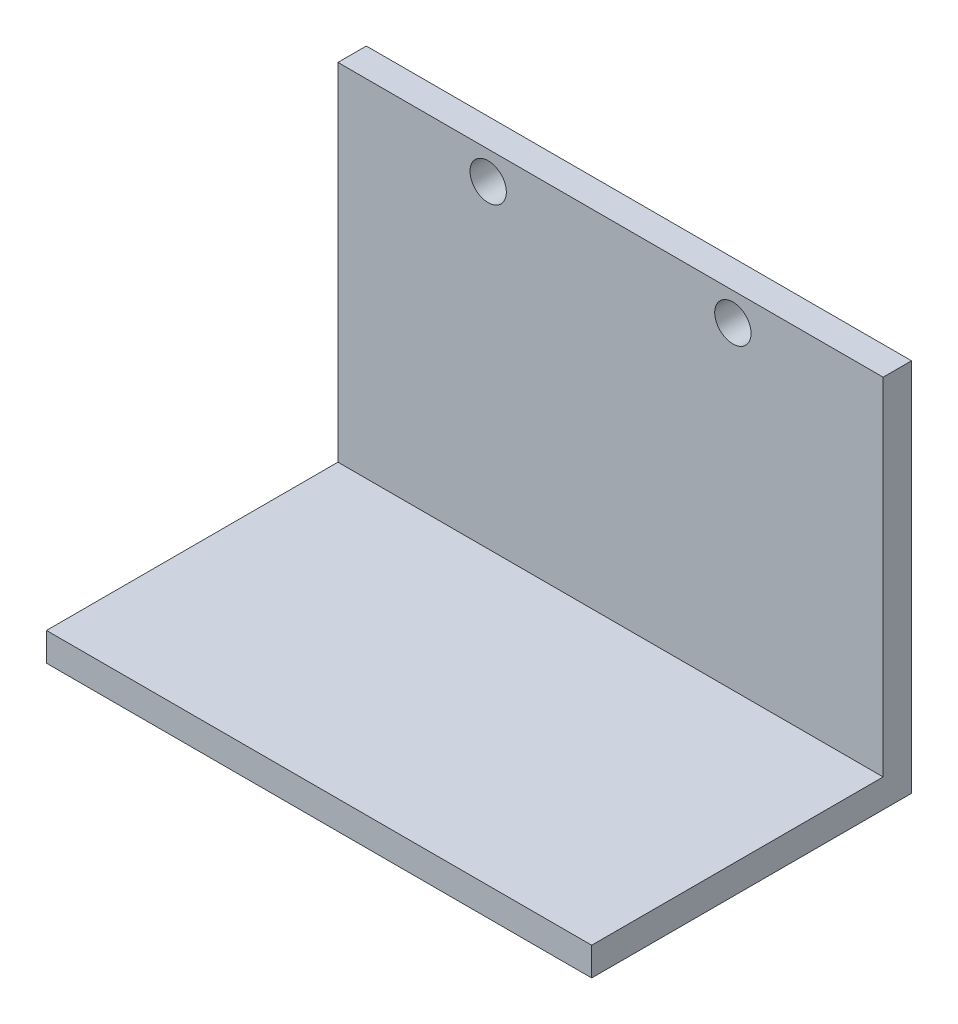
ISO-10303-21;
HEADER;
FILE_DESCRIPTION(('STEP AP214'),'2;1');
FILE_NAME('part.step','',(''),(''),'','','');
FILE_SCHEMA(('AUTOMOTIVE_DESIGN { 1 0 10303 214 1 1 1 1 }'));
ENDSEC;
DATA;
#1=APPLICATION_CONTEXT('core data for automotive mechanical design processes');
#2=APPLICATION_PROTOCOL_DEFINITION('international standard','automotive_design',2000,#1);
#3=PRODUCT_CONTEXT('',#1,'mechanical');
#4=PRODUCT('Part','Part','',(#3));
#5=PRODUCT_RELATED_PRODUCT_CATEGORY('part','',(#4));
#6=PRODUCT_DEFINITION_FORMATION('','',#4);
#7=PRODUCT_DEFINITION_CONTEXT('part definition',#1,'design');
#8=PRODUCT_DEFINITION('design','',#6,#7);
#9=PRODUCT_DEFINITION_SHAPE('','',#8);
#10=(LENGTH_UNIT() NAMED_UNIT(*) SI_UNIT(.MILLI.,.METRE.));
#11=(NAMED_UNIT(*) PLANE_ANGLE_UNIT() SI_UNIT($,.RADIAN.));
#12=(NAMED_UNIT(*) SI_UNIT($,.STERADIAN.) SOLID_ANGLE_UNIT());
#13=UNCERTAINTY_MEASURE_WITH_UNIT(LENGTH_MEASURE(1.E-05),#10,'distance_accuracy_value','');
#14=(GEOMETRIC_REPRESENTATION_CONTEXT(3) GLOBAL_UNCERTAINTY_ASSIGNED_CONTEXT((#13)) GLOBAL_UNIT_ASSIGNED_CONTEXT((#10,
#11,#12)) REPRESENTATION_CONTEXT('',''));
#15=CARTESIAN_POINT('',(0.,0.,0.));
#16=DIRECTION('',(0.,0.,1.));
#17=DIRECTION('',(1.,0.,0.));
#18=AXIS2_PLACEMENT_3D('',#15,#16,#17);
#19=CARTESIAN_POINT('',(60.,0.,-35.1979965784261));
#20=DIRECTION('',(0.,0.,1.));
#21=DIRECTION('',(1.,0.,0.));
#22=AXIS2_PLACEMENT_3D('',#19,#20,#21);
#23=PLANE('',#22);
#24=CARTESIAN_POINT('',(43.4647260972209,35.,-35.1979965784261));
#25=DIRECTION('',(0.,0.,1.));
#26=DIRECTION('',(1.,0.,0.));
#27=AXIS2_PLACEMENT_3D('',#24,#25,#26);
#28=CIRCLE('',#27,2.);
#29=CARTESIAN_POINT('',(45.4647260972209,35.,-35.1979965784261));
#30=VERTEX_POINT('',#29);
#31=EDGE_CURVE('E160',#30,#30,#28,.T.);
#32=ORIENTED_EDGE('',*,*,#31,.T.);
#33=EDGE_LOOP('',(#32));
#34=FACE_BOUND('',#33,.T.);
#35=CARTESIAN_POINT('',(16.5352739027791,35.,-35.1979965784261));
#36=DIRECTION('',(0.,0.,1.));
#37=DIRECTION('',(1.,0.,0.));
#38=AXIS2_PLACEMENT_3D('',#35,#36,#37);
#39=CIRCLE('',#38,2.);
#40=CARTESIAN_POINT('',(18.5352739027791,35.,-35.1979965784261));
#41=VERTEX_POINT('',#40);
#42=EDGE_CURVE('E117',#41,#41,#39,.T.);
#43=ORIENTED_EDGE('',*,*,#42,.T.);
#44=EDGE_LOOP('',(#43));
#45=FACE_BOUND('',#44,.T.);
#46=DIRECTION('',(0.,1.,0.));
#47=VECTOR('',#46,1.);
#48=CARTESIAN_POINT('',(0.,0.,-35.1979965784261));
#49=LINE('',#48,#47);
#50=CARTESIAN_POINT('',(0.,-3.125,-35.1979965784261));
#51=VERTEX_POINT('',#50);
#52=CARTESIAN_POINT('',(0.,38.1,-35.1979965784261));
#53=VERTEX_POINT('',#52);
#54=EDGE_CURVE('E113',#51,#53,#49,.T.);
#55=ORIENTED_EDGE('',*,*,#54,.T.);
#56=DIRECTION('',(-1.,0.,0.));
#57=VECTOR('',#56,1.);
#58=CARTESIAN_POINT('',(60.,38.1,-35.1979965784261));
#59=LINE('',#58,#57);
#60=CARTESIAN_POINT('',(60.,38.1,-35.1979965784261));
#61=VERTEX_POINT('',#60);
#62=EDGE_CURVE('E11',#61,#53,#59,.T.);
#63=ORIENTED_EDGE('',*,*,#62,.F.);
#64=DIRECTION('',(0.,1.,0.));
#65=VECTOR('',#64,1.);
#66=CARTESIAN_POINT('',(60.,0.,-35.1979965784261));
#67=LINE('',#66,#65);
#68=CARTESIAN_POINT('',(60.,-3.125,-35.1979965784261));
#69=VERTEX_POINT('',#68);
#70=EDGE_CURVE('E78',#69,#61,#67,.T.);
#71=ORIENTED_EDGE('',*,*,#70,.F.);
#72=DIRECTION('',(-1.,0.,0.));
#73=VECTOR('',#72,1.);
#74=CARTESIAN_POINT('',(60.,-3.125,-35.1979965784261));
#75=LINE('',#74,#73);
#76=EDGE_CURVE('E109',#69,#51,#75,.T.);
#77=ORIENTED_EDGE('',*,*,#76,.T.);
#78=EDGE_LOOP('',(#55,#63,#71,#77));
#79=FACE_BOUND('',#78,.T.);
#80=ADVANCED_FACE('F32',(#34,#45,#79),#23,.F.);
#81=CARTESIAN_POINT('',(60.,38.1,-32.0729965784261));
#82=DIRECTION('',(0.,1.,0.));
#83=DIRECTION('',(0.,0.,1.));
#84=AXIS2_PLACEMENT_3D('',#81,#82,#83);
#85=PLANE('',#84);
#86=DIRECTION('',(0.,0.,-1.));
#87=VECTOR('',#86,1.);
#88=CARTESIAN_POINT('',(0.,38.1,-32.0729965784261));
#89=LINE('',#88,#87);
#90=CARTESIAN_POINT('',(0.,38.1,-32.0729965784261));
#91=VERTEX_POINT('',#90);
#92=EDGE_CURVE('E116',#91,#53,#89,.T.);
#93=ORIENTED_EDGE('',*,*,#92,.F.);
#94=DIRECTION('',(-1.,0.,0.));
#95=VECTOR('',#94,1.);
#96=CARTESIAN_POINT('',(60.,38.1,-32.0729965784261));
#97=LINE('',#96,#95);
#98=CARTESIAN_POINT('',(60.,38.1,-32.0729965784261));
#99=VERTEX_POINT('',#98);
#100=EDGE_CURVE('E40',#99,#91,#97,.T.);
#101=ORIENTED_EDGE('',*,*,#100,.F.);
#102=DIRECTION('',(0.,0.,-1.));
#103=VECTOR('',#102,1.);
#104=CARTESIAN_POINT('',(60.,38.1,-32.0729965784261));
#105=LINE('',#104,#103);
#106=EDGE_CURVE('E171',#99,#61,#105,.T.);
#107=ORIENTED_EDGE('',*,*,#106,.T.);
#108=ORIENTED_EDGE('',*,*,#62,.T.);
#109=EDGE_LOOP('',(#93,#101,#107,#108));
#110=FACE_BOUND('',#109,.T.);
#111=ADVANCED_FACE('F135',(#110),#85,.T.);
#112=CARTESIAN_POINT('',(60.,0.,-32.0729965784261));
#113=DIRECTION('',(0.,0.,1.));
#114=DIRECTION('',(1.,0.,0.));
#115=AXIS2_PLACEMENT_3D('',#112,#113,#114);
#116=PLANE('',#115);
#117=CARTESIAN_POINT('',(43.4647260972209,35.,-32.0729965784261));
#118=DIRECTION('',(0.,0.,1.));
#119=DIRECTION('',(1.,0.,0.));
#120=AXIS2_PLACEMENT_3D('',#117,#118,#119);
#121=CIRCLE('',#120,2.);
#122=CARTESIAN_POINT('',(45.4647260972209,35.,-32.0729965784261));
#123=VERTEX_POINT('',#122);
#124=EDGE_CURVE('E173',#123,#123,#121,.T.);
#125=ORIENTED_EDGE('',*,*,#124,.F.);
#126=EDGE_LOOP('',(#125));
#127=FACE_BOUND('',#126,.T.);
#128=CARTESIAN_POINT('',(16.5352739027791,35.,-32.0729965784261));
#129=DIRECTION('',(0.,0.,1.));
#130=DIRECTION('',(1.,0.,0.));
#131=AXIS2_PLACEMENT_3D('',#128,#129,#130);
#132=CIRCLE('',#131,2.);
#133=CARTESIAN_POINT('',(18.5352739027791,35.,-32.0729965784261));
#134=VERTEX_POINT('',#133);
#135=EDGE_CURVE('E164',#134,#134,#132,.T.);
#136=ORIENTED_EDGE('',*,*,#135,.F.);
#137=EDGE_LOOP('',(#136));
#138=FACE_BOUND('',#137,.T.);
#139=DIRECTION('',(0.,1.,0.));
#140=VECTOR('',#139,1.);
#141=CARTESIAN_POINT('',(0.,0.,-32.0729965784261));
#142=LINE('',#141,#140);
#143=CARTESIAN_POINT('',(0.,0.,-32.0729965784261));
#144=VERTEX_POINT('',#143);
#145=EDGE_CURVE('E120',#144,#91,#142,.T.);
#146=ORIENTED_EDGE('',*,*,#145,.F.);
#147=DIRECTION('',(-1.,0.,0.));
#148=VECTOR('',#147,1.);
#149=CARTESIAN_POINT('',(60.,0.,-32.0729965784261));
#150=LINE('',#149,#148);
#151=CARTESIAN_POINT('',(60.,0.,-32.0729965784261));
#152=VERTEX_POINT('',#151);
#153=EDGE_CURVE('E99',#152,#144,#150,.T.);
#154=ORIENTED_EDGE('',*,*,#153,.F.);
#155=DIRECTION('',(0.,1.,0.));
#156=VECTOR('',#155,1.);
#157=CARTESIAN_POINT('',(60.,0.,-32.0729965784261));
#158=LINE('',#157,#156);
#159=EDGE_CURVE('E105',#152,#99,#158,.T.);
#160=ORIENTED_EDGE('',*,*,#159,.T.);
#161=ORIENTED_EDGE('',*,*,#100,.T.);
#162=EDGE_LOOP('',(#146,#154,#160,#161));
#163=FACE_BOUND('',#162,.T.);
#164=ADVANCED_FACE('F132',(#127,#138,#163),#116,.T.);
#165=CARTESIAN_POINT('',(60.,0.,0.));
#166=DIRECTION('',(0.,1.,0.));
#167=DIRECTION('',(0.,0.,1.));
#168=AXIS2_PLACEMENT_3D('',#165,#166,#167);
#169=PLANE('',#168);
#170=DIRECTION('',(0.,0.,-1.));
#171=VECTOR('',#170,1.);
#172=CARTESIAN_POINT('',(0.,0.,0.));
#173=LINE('',#172,#171);
#174=CARTESIAN_POINT('',(0.,0.,0.));
#175=VERTEX_POINT('',#174);
#176=EDGE_CURVE('E94',#175,#144,#173,.T.);
#177=ORIENTED_EDGE('',*,*,#176,.F.);
#178=DIRECTION('',(-1.,0.,0.));
#179=VECTOR('',#178,1.);
#180=CARTESIAN_POINT('',(60.,0.,0.));
#181=LINE('',#180,#179);
#182=CARTESIAN_POINT('',(60.,0.,0.));
#183=VERTEX_POINT('',#182);
#184=EDGE_CURVE('E89',#183,#175,#181,.T.);
#185=ORIENTED_EDGE('',*,*,#184,.F.);
#186=DIRECTION('',(0.,0.,-1.));
#187=VECTOR('',#186,1.);
#188=CARTESIAN_POINT('',(60.,0.,0.));
#189=LINE('',#188,#187);
#190=EDGE_CURVE('E92',#183,#152,#189,.T.);
#191=ORIENTED_EDGE('',*,*,#190,.T.);
#192=ORIENTED_EDGE('',*,*,#153,.T.);
#193=EDGE_LOOP('',(#177,#185,#191,#192));
#194=FACE_BOUND('',#193,.T.);
#195=ADVANCED_FACE('F91',(#194),#169,.T.);
#196=CARTESIAN_POINT('',(60.,-3.125,0.));
#197=DIRECTION('',(0.,0.,1.));
#198=DIRECTION('',(1.,0.,0.));
#199=AXIS2_PLACEMENT_3D('',#196,#197,#198);
#200=PLANE('',#199);
#201=DIRECTION('',(0.,1.,0.));
#202=VECTOR('',#201,1.);
#203=CARTESIAN_POINT('',(0.,-3.125,0.));
#204=LINE('',#203,#202);
#205=CARTESIAN_POINT('',(0.,-3.125,0.));
#206=VERTEX_POINT('',#205);
#207=EDGE_CURVE('E124',#206,#175,#204,.T.);
#208=ORIENTED_EDGE('',*,*,#207,.F.);
#209=DIRECTION('',(-1.,0.,0.));
#210=VECTOR('',#209,1.);
#211=CARTESIAN_POINT('',(60.,-3.125,0.));
#212=LINE('',#211,#210);
#213=CARTESIAN_POINT('',(60.,-3.125,0.));
#214=VERTEX_POINT('',#213);
#215=EDGE_CURVE('E69',#214,#206,#212,.T.);
#216=ORIENTED_EDGE('',*,*,#215,.F.);
#217=DIRECTION('',(0.,1.,0.));
#218=VECTOR('',#217,1.);
#219=CARTESIAN_POINT('',(60.,-3.125,0.));
#220=LINE('',#219,#218);
#221=EDGE_CURVE('E103',#214,#183,#220,.T.);
#222=ORIENTED_EDGE('',*,*,#221,.T.);
#223=ORIENTED_EDGE('',*,*,#184,.T.);
#224=EDGE_LOOP('',(#208,#216,#222,#223));
#225=FACE_BOUND('',#224,.T.);
#226=ADVANCED_FACE('F107',(#225),#200,.T.);
#227=CARTESIAN_POINT('',(60.,-3.125,0.));
#228=DIRECTION('',(0.,1.,0.));
#229=DIRECTION('',(0.,0.,1.));
#230=AXIS2_PLACEMENT_3D('',#227,#228,#229);
#231=PLANE('',#230);
#232=DIRECTION('',(0.,0.,-1.));
#233=VECTOR('',#232,1.);
#234=CARTESIAN_POINT('',(0.,-3.125,0.));
#235=LINE('',#234,#233);
#236=EDGE_CURVE('E72',#206,#51,#235,.T.);
#237=ORIENTED_EDGE('',*,*,#236,.T.);
#238=ORIENTED_EDGE('',*,*,#76,.F.);
#239=DIRECTION('',(0.,0.,-1.));
#240=VECTOR('',#239,1.);
#241=CARTESIAN_POINT('',(60.,-3.125,0.));
#242=LINE('',#241,#240);
#243=EDGE_CURVE('E48',#214,#69,#242,.T.);
#244=ORIENTED_EDGE('',*,*,#243,.F.);
#245=ORIENTED_EDGE('',*,*,#215,.T.);
#246=EDGE_LOOP('',(#237,#238,#244,#245));
#247=FACE_BOUND('',#246,.T.);
#248=ADVANCED_FACE('F140',(#247),#231,.F.);
#249=CARTESIAN_POINT('',(60.,0.,-35.1979965784261));
#250=DIRECTION('',(-1.,0.,0.));
#251=DIRECTION('',(0.,0.,1.));
#252=AXIS2_PLACEMENT_3D('',#249,#250,#251);
#253=PLANE('',#252);
#254=ORIENTED_EDGE('',*,*,#70,.T.);
#255=ORIENTED_EDGE('',*,*,#106,.F.);
#256=ORIENTED_EDGE('',*,*,#159,.F.);
#257=ORIENTED_EDGE('',*,*,#190,.F.);
#258=ORIENTED_EDGE('',*,*,#221,.F.);
#259=ORIENTED_EDGE('',*,*,#243,.T.);
#260=EDGE_LOOP('',(#254,#255,#256,#257,#258,#259));
#261=FACE_BOUND('',#260,.T.);
#262=ADVANCED_FACE('F102',(#261),#253,.F.);
#263=CARTESIAN_POINT('',(0.,0.,-35.1979965784261));
#264=DIRECTION('',(-1.,0.,0.));
#265=DIRECTION('',(0.,0.,1.));
#266=AXIS2_PLACEMENT_3D('',#263,#264,#265);
#267=PLANE('',#266);
#268=ORIENTED_EDGE('',*,*,#54,.F.);
#269=ORIENTED_EDGE('',*,*,#236,.F.);
#270=ORIENTED_EDGE('',*,*,#207,.T.);
#271=ORIENTED_EDGE('',*,*,#176,.T.);
#272=ORIENTED_EDGE('',*,*,#145,.T.);
#273=ORIENTED_EDGE('',*,*,#92,.T.);
#274=EDGE_LOOP('',(#268,#269,#270,#271,#272,#273));
#275=FACE_BOUND('',#274,.T.);
#276=ADVANCED_FACE('F138',(#275),#267,.T.);
#277=CARTESIAN_POINT('',(16.5352739027791,35.,-42.0729965784261));
#278=DIRECTION('',(0.,0.,1.));
#279=DIRECTION('',(1.,0.,0.));
#280=AXIS2_PLACEMENT_3D('',#277,#278,#279);
#281=CYLINDRICAL_SURFACE('',#280,2.);
#282=ORIENTED_EDGE('',*,*,#135,.T.);
#283=EDGE_LOOP('',(#282));
#284=FACE_BOUND('',#283,.T.);
#285=ORIENTED_EDGE('',*,*,#42,.F.);
#286=EDGE_LOOP('',(#285));
#287=FACE_BOUND('',#286,.T.);
#288=ADVANCED_FACE('F184',(#284,#287),#281,.F.);
#289=CARTESIAN_POINT('',(43.4647260972209,35.,-42.0729965784261));
#290=DIRECTION('',(0.,0.,1.));
#291=DIRECTION('',(1.,0.,0.));
#292=AXIS2_PLACEMENT_3D('',#289,#290,#291);
#293=CYLINDRICAL_SURFACE('',#292,2.);
#294=ORIENTED_EDGE('',*,*,#124,.T.);
#295=EDGE_LOOP('',(#294));
#296=FACE_BOUND('',#295,.T.);
#297=ORIENTED_EDGE('',*,*,#31,.F.);
#298=EDGE_LOOP('',(#297));
#299=FACE_BOUND('',#298,.T.);
#300=ADVANCED_FACE('F177',(#296,#299),#293,.F.);
#301=CLOSED_SHELL('',(#80,#111,#164,#195,#226,#248,#262,#276,#288,#300));
#302=MANIFOLD_SOLID_BREP('B2',#301);
#303=ADVANCED_BREP_SHAPE_REPRESENTATION('',(#18,#302),#14);
#304=SHAPE_DEFINITION_REPRESENTATION(#9,#303);
ENDSEC;
END-ISO-10303-21;
